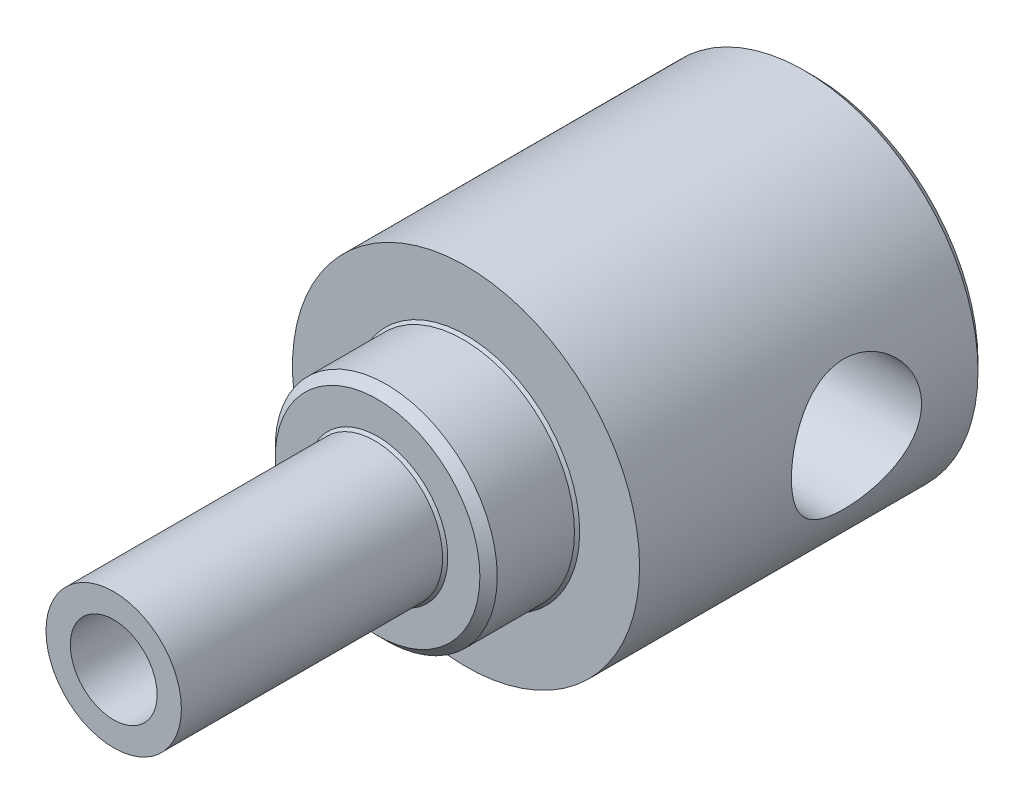
ISO-10303-21;
HEADER;
FILE_DESCRIPTION(('STEP AP214'),'2;1');
FILE_NAME('part.step','',(''),(''),'','','');
FILE_SCHEMA(('AUTOMOTIVE_DESIGN { 1 0 10303 214 1 1 1 1 }'));
ENDSEC;
DATA;
#1=APPLICATION_CONTEXT('core data for automotive mechanical design processes');
#2=APPLICATION_PROTOCOL_DEFINITION('international standard','automotive_design',2000,#1);
#3=PRODUCT_CONTEXT('',#1,'mechanical');
#4=PRODUCT('Part','Part','',(#3));
#5=PRODUCT_RELATED_PRODUCT_CATEGORY('part','',(#4));
#6=PRODUCT_DEFINITION_FORMATION('','',#4);
#7=PRODUCT_DEFINITION_CONTEXT('part definition',#1,'design');
#8=PRODUCT_DEFINITION('design','',#6,#7);
#9=PRODUCT_DEFINITION_SHAPE('','',#8);
#10=(LENGTH_UNIT() NAMED_UNIT(*) SI_UNIT(.MILLI.,.METRE.));
#11=(NAMED_UNIT(*) PLANE_ANGLE_UNIT() SI_UNIT($,.RADIAN.));
#12=(NAMED_UNIT(*) SI_UNIT($,.STERADIAN.) SOLID_ANGLE_UNIT());
#13=UNCERTAINTY_MEASURE_WITH_UNIT(LENGTH_MEASURE(1.E-05),#10,'distance_accuracy_value','');
#14=(GEOMETRIC_REPRESENTATION_CONTEXT(3) GLOBAL_UNCERTAINTY_ASSIGNED_CONTEXT((#13)) GLOBAL_UNIT_ASSIGNED_CONTEXT((#10,
#11,#12)) REPRESENTATION_CONTEXT('',''));
#15=CARTESIAN_POINT('',(0.,0.,0.));
#16=DIRECTION('',(0.,0.,1.));
#17=DIRECTION('',(1.,0.,0.));
#18=AXIS2_PLACEMENT_3D('',#15,#16,#17);
#19=CARTESIAN_POINT('',(0.,0.,2.03));
#20=DIRECTION('',(0.,0.,-1.));
#21=DIRECTION('',(-1.,0.,0.));
#22=AXIS2_PLACEMENT_3D('',#19,#20,#21);
#23=CYLINDRICAL_SURFACE('',#22,0.39);
#24=CARTESIAN_POINT('',(0.,0.,2.03));
#25=DIRECTION('',(0.,0.,1.));
#26=DIRECTION('',(1.,0.,0.));
#27=AXIS2_PLACEMENT_3D('',#24,#25,#26);
#28=CIRCLE('',#27,0.39);
#29=CARTESIAN_POINT('',(0.39,0.,2.03));
#30=VERTEX_POINT('',#29);
#31=EDGE_CURVE('E112',#30,#30,#28,.T.);
#32=ORIENTED_EDGE('',*,*,#31,.F.);
#33=EDGE_LOOP('',(#32));
#34=FACE_BOUND('',#33,.T.);
#35=CARTESIAN_POINT('',(-0.39,0.,0.51));
#36=CARTESIAN_POINT('',(-0.390003573981913,-0.00499348404305622,0.509995390479054));
#37=CARTESIAN_POINT('',(-0.389904208520105,-0.00998427020335295,0.510415272070743));
#38=CARTESIAN_POINT('',(-0.389526423050962,-0.0198132713252226,0.512068228847062));
#39=CARTESIAN_POINT('',(-0.389248333755489,-0.0246517508053416,0.51329980217857));
#40=CARTESIAN_POINT('',(-0.388539725112788,-0.0340486367913724,0.516540671192501));
#41=CARTESIAN_POINT('',(-0.388109198324649,-0.0386070296127043,0.518550004840077));
#42=CARTESIAN_POINT('',(-0.387143030348064,-0.0473230701978567,0.523285467073371));
#43=CARTESIAN_POINT('',(-0.386607367869382,-0.0514806365386137,0.52601174087931));
#44=CARTESIAN_POINT('',(-0.385478646054653,-0.059348926913769,0.532154503984005));
#45=CARTESIAN_POINT('',(-0.38488481559396,-0.0630515818181911,0.535581187919083));
#46=CARTESIAN_POINT('',(-0.383711975823547,-0.0698354839927525,0.543006177894276));
#47=CARTESIAN_POINT('',(-0.383132969678231,-0.0729165995386855,0.547004604798953));
#48=CARTESIAN_POINT('',(-0.382047536413422,-0.0784068787389949,0.555521249367071));
#49=CARTESIAN_POINT('',(-0.381542124453942,-0.0808070114923703,0.560045423555429));
#50=CARTESIAN_POINT('',(-0.380672777514302,-0.0848083376280224,0.569445313240605));
#51=CARTESIAN_POINT('',(-0.380308733819645,-0.0864101452051284,0.574320755172328));
#52=CARTESIAN_POINT('',(-0.379853043513059,-0.0883874908642381,0.582685744482339));
#53=CARTESIAN_POINT('',(-0.379711526167933,-0.0889913169642096,0.586120331988936));
#54=CARTESIAN_POINT('',(-0.379521283289299,-0.0897977830259027,0.593036019418668));
#55=CARTESIAN_POINT('',(-0.379472484818407,-0.0900007383379553,0.596517080610444));
#56=CARTESIAN_POINT('',(-0.379473319220205,-0.09,0.6));
#57=B_SPLINE_CURVE_WITH_KNOTS('',3,(#35,#36,#37,#38,#39,#40,#41,#42,#43,#44,#45,#46,#47,#48,#49,
#50,#51,#52,#53,#54,#55,#56),.UNSPECIFIED.,.F.,.F.,(4,2,2,2,2,2,2,2,2,2,4),(0.,
0.0149577270488295,0.0298878555921555,0.0448187130182498,0.0597525971052398,0.0749216905734965,
0.0900939954914772,0.105458991894533,0.120812148854305,0.131259378789806,0.141698386994673),.UNSPECIFIED.);
#58=CARTESIAN_POINT('',(-0.386813908746828,-0.0497493718553337,0.525));
#59=VERTEX_POINT('',#58);
#60=CARTESIAN_POINT('',(-0.379473319220206,-0.0899999999999998,0.6));
#61=VERTEX_POINT('',#60);
#62=EDGE_CURVE('E215',#59,#61,#57,.T.);
#63=ORIENTED_EDGE('',*,*,#62,.F.);
#64=CARTESIAN_POINT('',(0.,0.,0.525));
#65=DIRECTION('',(0.,0.,1.));
#66=DIRECTION('',(1.,0.,0.));
#67=AXIS2_PLACEMENT_3D('',#64,#65,#66);
#68=CIRCLE('',#67,0.39);
#69=CARTESIAN_POINT('',(-0.386813908746829,0.0497493718553304,0.525));
#70=VERTEX_POINT('',#69);
#71=EDGE_CURVE('E255',#59,#70,#68,.T.);
#72=ORIENTED_EDGE('',*,*,#71,.T.);
#73=CARTESIAN_POINT('',(-0.379473319220205,0.09,0.6));
#74=CARTESIAN_POINT('',(-0.379469419670721,0.0900046121325419,0.595008255870319));
#75=CARTESIAN_POINT('',(-0.379571713229179,0.0895850203535354,0.590019352257919));
#76=CARTESIAN_POINT('',(-0.379959200845348,0.0879333968278323,0.580194534874053));
#77=CARTESIAN_POINT('',(-0.380244046534698,0.0867029123997232,0.575358348074915));
#78=CARTESIAN_POINT('',(-0.380967362557247,0.0834652123050407,0.56596619423198));
#79=CARTESIAN_POINT('',(-0.381405834060902,0.081457990720594,0.561410229323468));
#80=CARTESIAN_POINT('',(-0.382385604440047,0.0767274668969404,0.552698205337723));
#81=CARTESIAN_POINT('',(-0.382926926903542,0.0740040003378031,0.548542238326701));
#82=CARTESIAN_POINT('',(-0.384062928906286,0.0678641163075334,0.540672182854271));
#83=CARTESIAN_POINT('',(-0.38465834942969,0.0644368709050795,0.536966647487533));
#84=CARTESIAN_POINT('',(-0.385829005049533,0.0570095642038938,0.530177176897509));
#85=CARTESIAN_POINT('',(-0.386404236313494,0.0530093948727697,0.527093359171956));
#86=CARTESIAN_POINT('',(-0.387477959506141,0.0444911134504308,0.521600148442213));
#87=CARTESIAN_POINT('',(-0.38797544475904,0.0399673482353219,0.519199317156233));
#88=CARTESIAN_POINT('',(-0.388828730787453,0.0305682671857995,0.515196555432417));
#89=CARTESIAN_POINT('',(-0.389184636801013,0.0256932156637482,0.513594031376055));
#90=CARTESIAN_POINT('',(-0.389629742942753,0.0173262734539094,0.51161475608173));
#91=CARTESIAN_POINT('',(-0.389767803380643,0.0138891785569138,0.511010065542118));
#92=CARTESIAN_POINT('',(-0.389953269308914,0.00696863982609787,0.510202486987269));
#93=CARTESIAN_POINT('',(-0.390000749822874,0.00348523675780692,0.509999266446182));
#94=CARTESIAN_POINT('',(-0.390000000000255,2.74694234790485E-13,0.509999999998896));
#95=B_SPLINE_CURVE_WITH_KNOTS('',3,(#73,#74,#75,#76,#77,#78,#79,#80,#81,#82,#83,#84,#85,#86,#87,
#88,#89,#90,#91,#92,#93,#94),.UNSPECIFIED.,.F.,.F.,(4,2,2,2,2,2,2,2,2,2,4),(0.,
0.0149522390434612,0.0298760290122494,0.0447999326859618,0.0597272631722878,0.0749042569988167,
0.0900841164254572,0.105446632059966,0.120797707064649,0.131252376016773,0.141698382036021),.UNSPECIFIED.);
#96=CARTESIAN_POINT('',(-0.379473319220205,0.09,0.6));
#97=VERTEX_POINT('',#96);
#98=EDGE_CURVE('E228',#97,#70,#95,.T.);
#99=ORIENTED_EDGE('',*,*,#98,.F.);
#100=DIRECTION('',(0.,0.,-1.));
#101=VECTOR('',#100,1.);
#102=CARTESIAN_POINT('',(-0.379473319220205,0.0900000000000001,2.03));
#103=LINE('',#102,#101);
#104=CARTESIAN_POINT('',(-0.379473319220205,0.09,1.41));
#105=VERTEX_POINT('',#104);
#106=EDGE_CURVE('E236',#105,#97,#103,.T.);
#107=ORIENTED_EDGE('',*,*,#106,.F.);
#108=CARTESIAN_POINT('',(-0.379473319220206,-0.0899999999999999,1.41));
#109=CARTESIAN_POINT('',(-0.379469419887523,-0.0900046113034587,1.41499158668145));
#110=CARTESIAN_POINT('',(-0.379571706902541,-0.0895850463478752,1.41998033387261));
#111=CARTESIAN_POINT('',(-0.379959182987832,-0.0879334745040998,1.42980516055504));
#112=CARTESIAN_POINT('',(-0.380244035159054,-0.0867029639871329,1.43464150407447));
#113=CARTESIAN_POINT('',(-0.3809673677522,-0.0834651883835822,1.44403387336327));
#114=CARTESIAN_POINT('',(-0.381405846719146,-0.0814579306534438,1.44858990178697));
#115=CARTESIAN_POINT('',(-0.382385619845448,-0.0767273912600067,1.45730191347996));
#116=CARTESIAN_POINT('',(-0.38292693465544,-0.0740039657395931,1.46145781614631));
#117=CARTESIAN_POINT('',(-0.384062938206583,-0.0678640586194219,1.46932788079495));
#118=CARTESIAN_POINT('',(-0.384658369291179,-0.0644367289589389,1.47303347428764));
#119=CARTESIAN_POINT('',(-0.385829022078421,-0.0570094720332387,1.47982291534215));
#120=CARTESIAN_POINT('',(-0.386404240585479,-0.0530094547294066,1.48290666495298));
#121=CARTESIAN_POINT('',(-0.387477810257076,-0.0444922026531543,1.48839908569764));
#122=CARTESIAN_POINT('',(-0.387975177799717,-0.0399694380783504,1.49079939051862));
#123=CARTESIAN_POINT('',(-0.388828510912156,-0.0305715374153859,1.49480245361251));
#124=CARTESIAN_POINT('',(-0.389184501449783,-0.0256964637265442,1.49640535272358));
#125=CARTESIAN_POINT('',(-0.389709733747058,-0.0158219440541628,1.49874095673185));
#126=CARTESIAN_POINT('',(-0.389882110486474,-0.0108261268874325,1.49948828656345));
#127=CARTESIAN_POINT('',(-0.390031579734262,-0.00077714029145394,1.50013733575168));
#128=CARTESIAN_POINT('',(-0.390008692589383,0.00427602310744478,1.50003914321283));
#129=CARTESIAN_POINT('',(-0.389772578294638,0.0141949778245059,1.49901065699915));
#130=CARTESIAN_POINT('',(-0.389562963537571,0.0190625052989266,1.49809615479739));
#131=CARTESIAN_POINT('',(-0.388981097795011,0.02857303361289,1.4954862620337));
#132=CARTESIAN_POINT('',(-0.388608840284936,0.0332160254366503,1.49379084014421));
#133=CARTESIAN_POINT('',(-0.387737805264789,0.0421887991068171,1.48965368879051));
#134=CARTESIAN_POINT('',(-0.387238039746749,0.0465157791746464,1.48720609932659));
#135=CARTESIAN_POINT('',(-0.386166594062722,0.0547031539270286,1.48163854311458));
#136=CARTESIAN_POINT('',(-0.385594905015786,0.0585634908759636,1.47851849329869));
#137=CARTESIAN_POINT('',(-0.384426716747437,0.0658017373213646,1.47160953181118));
#138=CARTESIAN_POINT('',(-0.38382994934358,0.0691664965039653,1.46780687698392));
#139=CARTESIAN_POINT('',(-0.382690934759353,0.0752140224511687,1.45968389352286));
#140=CARTESIAN_POINT('',(-0.382148702498639,0.0778966028913197,1.45536342393065));
#141=CARTESIAN_POINT('',(-0.381179237320822,0.0825105558434735,1.44630385213208));
#142=CARTESIAN_POINT('',(-0.380752490714059,0.0844387664252337,1.44156308789224));
#143=CARTESIAN_POINT('',(-0.380068955050082,0.0874644857453208,1.43181548560193));
#144=CARTESIAN_POINT('',(-0.379811912771557,0.0885632325064331,1.42680905607467));
#145=CARTESIAN_POINT('',(-0.379594795426623,0.0894865089074196,1.41980049131784));
#146=CARTESIAN_POINT('',(-0.379549303436279,0.0896791162454702,1.41784395867174));
#147=CARTESIAN_POINT('',(-0.379488583912478,0.089935709620331,1.41392525420415));
#148=CARTESIAN_POINT('',(-0.379473306521465,0.0899999075493937,1.41196309703207));
#149=CARTESIAN_POINT('',(-0.379473319220225,0.0900000000000015,1.41));
#150=B_SPLINE_CURVE_WITH_KNOTS('',3,(#108,#109,#110,#111,#112,#113,#114,#115,#116,#117,#118,
#119,#120,#121,#122,#123,#124,#125,#126,#127,#128,#129,#130,#131,#132,#133,#134,#135,#136,#137,
#138,#139,#140,#141,#142,#143,#144,#145,#146,#147,#148,#149),.UNSPECIFIED.,.F.,.F.,(4,2,2,2,2,2,
2,2,2,2,2,2,2,2,2,2,2,2,2,2,4),(0.,0.0149517706768174,0.0298760290377431,0.0448001460569251,
0.0597272631866968,0.0749044954110684,0.0900841164431795,0.105442268392468,0.120797706814097,
0.135886547906178,0.150973816740752,0.165775400329849,0.180577577754458,0.19549813238397,
0.210420531180046,0.225686424667633,0.240956483282895,0.256289877432888,0.271600340107902,
0.277496389182992,0.28338270095603),.UNSPECIFIED.);
#151=CARTESIAN_POINT('',(-0.379473319220206,-0.0899999999999999,1.41));
#152=VERTEX_POINT('',#151);
#153=EDGE_CURVE('E108',#152,#105,#150,.T.);
#154=ORIENTED_EDGE('',*,*,#153,.F.);
#155=DIRECTION('',(0.,0.,-1.));
#156=VECTOR('',#155,1.);
#157=CARTESIAN_POINT('',(-0.379473319220206,-0.0899999999999998,2.03));
#158=LINE('',#157,#156);
#159=EDGE_CURVE('E262',#61,#152,#158,.F.);
#160=ORIENTED_EDGE('',*,*,#159,.F.);
#161=EDGE_LOOP('',(#63,#72,#99,#107,#154,#160));
#162=FACE_BOUND('',#161,.T.);
#163=ADVANCED_FACE('F44',(#34,#162),#23,.T.);
#164=CARTESIAN_POINT('',(0.,0.,-2.));
#165=DIRECTION('',(0.,0.,1.));
#166=DIRECTION('',(1.,0.,0.));
#167=AXIS2_PLACEMENT_3D('',#164,#165,#166);
#168=CYLINDRICAL_SURFACE('',#167,1.);
#169=CARTESIAN_POINT('',(-1.,0.,-1.625));
#170=CARTESIAN_POINT('',(-1.00000054364038,-0.0203087647344633,-1.62500072557578));
#171=CARTESIAN_POINT('',(-0.999375948207983,-0.0406125604454483,-1.6233450599379));
#172=CARTESIAN_POINT('',(-0.996946740017296,-0.08061336308809,-1.61679295118252));
#173=CARTESIAN_POINT('',(-0.995142297234891,-0.100310456996903,-1.61189697488236));
#174=CARTESIAN_POINT('',(-0.990547080978953,-0.13851519624772,-1.59906174955706));
#175=CARTESIAN_POINT('',(-0.987758210873942,-0.157025056040572,-1.59112837079454));
#176=CARTESIAN_POINT('',(-0.981471919413041,-0.192449827540061,-1.57247339674606));
#177=CARTESIAN_POINT('',(-0.977974308067594,-0.20936430979446,-1.56175105361403));
#178=CARTESIAN_POINT('',(-0.970465617429366,-0.241836604261467,-1.53734686723221));
#179=CARTESIAN_POINT('',(-0.966440006463946,-0.257317682537838,-1.52356743443489));
#180=CARTESIAN_POINT('',(-0.958400552173284,-0.285811053685867,-1.49364739133555));
#181=CARTESIAN_POINT('',(-0.954386712818773,-0.298822590897855,-1.47750606097899));
#182=CARTESIAN_POINT('',(-0.946656176563854,-0.32249550554012,-1.4425706331182));
#183=CARTESIAN_POINT('',(-0.942956622126213,-0.333048482989996,-1.42369890835975));
#184=CARTESIAN_POINT('',(-0.936499650519446,-0.350796615834614,-1.38428791146166));
#185=CARTESIAN_POINT('',(-0.933741857162724,-0.357993112400869,-1.36374930922539));
#186=CARTESIAN_POINT('',(-0.929636032326957,-0.368521077543443,-1.32247081493193));
#187=CARTESIAN_POINT('',(-0.928234811850985,-0.371998983050756,-1.30177374036202));
#188=CARTESIAN_POINT('',(-0.926845154619263,-0.375448891333818,-1.26004596046715));
#189=CARTESIAN_POINT('',(-0.926856134400112,-0.375422342006888,-1.23901539651731));
#190=CARTESIAN_POINT('',(-0.928243778843706,-0.371976074023889,-1.19855761869985));
#191=CARTESIAN_POINT('',(-0.929538672114408,-0.368759521272199,-1.17910977348979));
#192=CARTESIAN_POINT('',(-0.933212345212229,-0.359360419671135,-1.14105321239784));
#193=CARTESIAN_POINT('',(-0.935591288264298,-0.35317742415823,-1.12244462334631));
#194=CARTESIAN_POINT('',(-0.941214255458168,-0.337909371429674,-1.08618073306817));
#195=CARTESIAN_POINT('',(-0.944473794965724,-0.328771621842729,-1.06855012846974));
#196=CARTESIAN_POINT('',(-0.95148552535299,-0.307890184406767,-1.0350135656022));
#197=CARTESIAN_POINT('',(-0.955237886144189,-0.296145596822248,-1.01910820562006));
#198=CARTESIAN_POINT('',(-0.9631200971464,-0.269454451916365,-0.988349084087298));
#199=CARTESIAN_POINT('',(-0.967258368638806,-0.254345746792387,-0.973637839812981));
#200=CARTESIAN_POINT('',(-0.975229320410584,-0.221828147704757,-0.946915508448546));
#201=CARTESIAN_POINT('',(-0.97906195366498,-0.204418900874342,-0.934904836348581));
#202=CARTESIAN_POINT('',(-0.986065987022598,-0.167430859248104,-0.913767400734371));
#203=CARTESIAN_POINT('',(-0.989226245649014,-0.14782267846118,-0.904688104694735));
#204=CARTESIAN_POINT('',(-0.994446795817431,-0.107209212631146,-0.890004348932489));
#205=CARTESIAN_POINT('',(-0.996507575853736,-0.086204552711442,-0.88439834585972));
#206=CARTESIAN_POINT('',(-0.99921110807016,-0.044593810787166,-0.877094303114516));
#207=CARTESIAN_POINT('',(-0.999923422564228,-0.0240259048905516,-0.875204348404374));
#208=CARTESIAN_POINT('',(-1.0000647342503,0.0171431188137555,-0.874827234025019));
#209=CARTESIAN_POINT('',(-0.999494015967107,0.0377442282458409,-0.876339319920801));
#210=CARTESIAN_POINT('',(-0.997179274431657,0.0775655121404672,-0.882577510577172));
#211=CARTESIAN_POINT('',(-0.995481177405943,0.0968083320018425,-0.887177885934289));
#212=CARTESIAN_POINT('',(-0.991128692729112,0.134235438739297,-0.899296518136812));
#213=CARTESIAN_POINT('',(-0.988474180704401,0.152419587586852,-0.906815154486943));
#214=CARTESIAN_POINT('',(-0.982374061019898,0.187811941277571,-0.924796603109936));
#215=CARTESIAN_POINT('',(-0.978907500525996,0.204975770889572,-0.935339432306102));
#216=CARTESIAN_POINT('',(-0.971566678909033,0.237348177931534,-0.958979525792633));
#217=CARTESIAN_POINT('',(-0.967692267513977,0.252556030067155,-0.972077733135332));
#218=CARTESIAN_POINT('',(-0.959683323737856,0.28150769968662,-1.00135103053208));
#219=CARTESIAN_POINT('',(-0.955546741299118,0.295115385310778,-1.01766054569705));
#220=CARTESIAN_POINT('',(-0.947697039327335,0.319427625077901,-1.05241284617304));
#221=CARTESIAN_POINT('',(-0.943983957837181,0.330131918529352,-1.07085582283263));
#222=CARTESIAN_POINT('',(-0.937417074706252,0.348344433802637,-1.10950399670375));
#223=CARTESIAN_POINT('',(-0.934566901381225,0.355839213640366,-1.12971618652393));
#224=CARTESIAN_POINT('',(-0.930135082687835,0.367269708690373,-1.17125244097115));
#225=CARTESIAN_POINT('',(-0.928552652595015,0.371207625769266,-1.19257580906596));
#226=CARTESIAN_POINT('',(-0.926939737027092,0.375215867739331,-1.23425403986796));
#227=CARTESIAN_POINT('',(-0.92681611188795,0.375518328740143,-1.25458315790885));
#228=CARTESIAN_POINT('',(-0.927896032504864,0.37284178910712,-1.2949863290572));
#229=CARTESIAN_POINT('',(-0.929099452417085,0.369863099625191,-1.31506040616764));
#230=CARTESIAN_POINT('',(-0.932620353799477,0.360889539074316,-1.35376180668543));
#231=CARTESIAN_POINT('',(-0.934902713397605,0.354989495790965,-1.37241458656303));
#232=CARTESIAN_POINT('',(-0.940303870788675,0.340424241950145,-1.40847637712191));
#233=CARTESIAN_POINT('',(-0.943422880000124,0.331758332362456,-1.42588507201707));
#234=CARTESIAN_POINT('',(-0.95034930974719,0.311380189845284,-1.4599566974249));
#235=CARTESIAN_POINT('',(-0.954184246098995,0.299532082007499,-1.47653269920011));
#236=CARTESIAN_POINT('',(-0.96201561689636,0.273336214324792,-1.50753539024267));
#237=CARTESIAN_POINT('',(-0.9660121023588,0.258987660032028,-1.52196139369665));
#238=CARTESIAN_POINT('',(-0.973976061523714,0.227270099196148,-1.5490504889555));
#239=CARTESIAN_POINT('',(-0.977930262251346,0.209779661053246,-1.56157593835868));
#240=CARTESIAN_POINT('',(-0.985136286142841,0.172803305800207,-1.58350566381913));
#241=CARTESIAN_POINT('',(-0.98838805462897,0.153317233522656,-1.59290969693409));
#242=CARTESIAN_POINT('',(-0.993935731516625,0.111999770500577,-1.60859420726208));
#243=CARTESIAN_POINT('',(-0.996184142895872,0.0901033555585518,-1.61472176615047));
#244=CARTESIAN_POINT('',(-0.999215605448985,0.0454689334015956,-1.62292323998017));
#245=CARTESIAN_POINT('',(-0.999999391509915,0.0227313540912148,-1.62499918787183));
#246=CARTESIAN_POINT('',(-1.,0.,-1.625));
#247=B_SPLINE_CURVE_WITH_KNOTS('',3,(#169,#170,#171,#172,#173,#174,#175,#176,#177,#178,#179,
#180,#181,#182,#183,#184,#185,#186,#187,#188,#189,#190,#191,#192,#193,#194,#195,#196,#197,#198,
#199,#200,#201,#202,#203,#204,#205,#206,#207,#208,#209,#210,#211,#212,#213,#214,#215,#216,#217,
#218,#219,#220,#221,#222,#223,#224,#225,#226,#227,#228,#229,#230,#231,#232,#233,#234,#235,#236,
#237,#238,#239,#240,#241,#242,#243,#244,#245,#246),.UNSPECIFIED.,.T.,.F.,(4,2,2,2,2,2,2,2,2,2,2,
2,2,2,2,2,2,2,2,2,2,2,2,2,2,2,2,2,2,2,2,2,2,2,2,2,2,2,4),(0.,0.0608424503901399,
0.121676137382615,0.182392842303393,0.243125844902372,0.306184046456788,0.369261512314054,
0.434741686254146,0.500195673380335,0.562964686010986,0.625707765135572,0.684695862736232,
0.743692845087777,0.80380602090385,0.863939976796951,0.928115383275836,0.992300644698969,
1.05747843815149,1.12262724918342,1.18431254902612,1.24598417091261,1.3052860947459,
1.36459573307244,1.4256480545853,1.48672294998597,1.55134129857545,1.61596544723666,
1.6808576667413,1.74570968729965,1.80639690858919,1.86707837539744,1.92590785593563,
1.98475221651056,2.04668117957997,2.10862985486195,2.17393082400439,2.23923687438205,
2.3073712874494,2.37547150435961),.UNSPECIFIED.);
#248=CARTESIAN_POINT('',(-1.,0.,-1.625));
#249=VERTEX_POINT('',#248);
#250=EDGE_CURVE('E181',#249,#249,#247,.T.);
#251=ORIENTED_EDGE('',*,*,#250,.F.);
#252=EDGE_LOOP('',(#251));
#253=FACE_BOUND('',#252,.T.);
#254=CARTESIAN_POINT('',(1.,0.,-1.625));
#255=CARTESIAN_POINT('',(1.00000054364038,0.0203087647344633,-1.62500072557578));
#256=CARTESIAN_POINT('',(0.999375948207983,0.0406125604454483,-1.6233450599379));
#257=CARTESIAN_POINT('',(0.996946740017296,0.08061336308809,-1.61679295118252));
#258=CARTESIAN_POINT('',(0.995142297234891,0.100310456996903,-1.61189697488236));
#259=CARTESIAN_POINT('',(0.990547080978953,0.13851519624772,-1.59906174955706));
#260=CARTESIAN_POINT('',(0.987758210873942,0.157025056040572,-1.59112837079454));
#261=CARTESIAN_POINT('',(0.981471919413041,0.192449827540061,-1.57247339674606));
#262=CARTESIAN_POINT('',(0.977974308067594,0.20936430979446,-1.56175105361403));
#263=CARTESIAN_POINT('',(0.970465617429366,0.241836604261467,-1.53734686723221));
#264=CARTESIAN_POINT('',(0.966440006463946,0.257317682537838,-1.52356743443489));
#265=CARTESIAN_POINT('',(0.958400552173284,0.285811053685867,-1.49364739133555));
#266=CARTESIAN_POINT('',(0.954386712818773,0.298822590897855,-1.47750606097899));
#267=CARTESIAN_POINT('',(0.946656176563854,0.32249550554012,-1.4425706331182));
#268=CARTESIAN_POINT('',(0.942956622126213,0.333048482989996,-1.42369890835975));
#269=CARTESIAN_POINT('',(0.936499650519446,0.350796615834614,-1.38428791146166));
#270=CARTESIAN_POINT('',(0.933741857162724,0.357993112400869,-1.36374930922539));
#271=CARTESIAN_POINT('',(0.929636032326957,0.368521077543443,-1.32247081493193));
#272=CARTESIAN_POINT('',(0.928234811850985,0.371998983050756,-1.30177374036202));
#273=CARTESIAN_POINT('',(0.926845154619263,0.375448891333818,-1.26004596046715));
#274=CARTESIAN_POINT('',(0.926856134400112,0.375422342006888,-1.23901539651731));
#275=CARTESIAN_POINT('',(0.928243778843706,0.371976074023889,-1.19855761869985));
#276=CARTESIAN_POINT('',(0.929538672114408,0.368759521272199,-1.17910977348979));
#277=CARTESIAN_POINT('',(0.933212345212229,0.359360419671135,-1.14105321239784));
#278=CARTESIAN_POINT('',(0.935591288264298,0.35317742415823,-1.12244462334631));
#279=CARTESIAN_POINT('',(0.941214255458168,0.337909371429674,-1.08618073306817));
#280=CARTESIAN_POINT('',(0.944473794965724,0.328771621842729,-1.06855012846974));
#281=CARTESIAN_POINT('',(0.95148552535299,0.307890184406767,-1.0350135656022));
#282=CARTESIAN_POINT('',(0.955237886144189,0.296145596822248,-1.01910820562006));
#283=CARTESIAN_POINT('',(0.9631200971464,0.269454451916365,-0.988349084087298));
#284=CARTESIAN_POINT('',(0.967258368638806,0.254345746792387,-0.973637839812981));
#285=CARTESIAN_POINT('',(0.975229320410584,0.221828147704757,-0.946915508448546));
#286=CARTESIAN_POINT('',(0.97906195366498,0.204418900874342,-0.934904836348581));
#287=CARTESIAN_POINT('',(0.986065987022598,0.167430859248104,-0.913767400734371));
#288=CARTESIAN_POINT('',(0.989226245649014,0.14782267846118,-0.904688104694735));
#289=CARTESIAN_POINT('',(0.994446795817431,0.107209212631146,-0.890004348932489));
#290=CARTESIAN_POINT('',(0.996507575853736,0.086204552711442,-0.88439834585972));
#291=CARTESIAN_POINT('',(0.99921110807016,0.044593810787166,-0.877094303114516));
#292=CARTESIAN_POINT('',(0.999923422564228,0.0240259048905516,-0.875204348404374));
#293=CARTESIAN_POINT('',(1.0000647342503,-0.0171431188137555,-0.874827234025019));
#294=CARTESIAN_POINT('',(0.999494015967107,-0.0377442282458409,-0.876339319920801));
#295=CARTESIAN_POINT('',(0.997179274431657,-0.0775655121404672,-0.882577510577172));
#296=CARTESIAN_POINT('',(0.995481177405943,-0.0968083320018425,-0.887177885934289));
#297=CARTESIAN_POINT('',(0.991128692729112,-0.134235438739297,-0.899296518136812));
#298=CARTESIAN_POINT('',(0.988474180704401,-0.152419587586852,-0.906815154486943));
#299=CARTESIAN_POINT('',(0.982374061019898,-0.187811941277571,-0.924796603109936));
#300=CARTESIAN_POINT('',(0.978907500525996,-0.204975770889572,-0.935339432306102));
#301=CARTESIAN_POINT('',(0.971566678909033,-0.237348177931534,-0.958979525792633));
#302=CARTESIAN_POINT('',(0.967692267513977,-0.252556030067155,-0.972077733135332));
#303=CARTESIAN_POINT('',(0.959683323737856,-0.28150769968662,-1.00135103053208));
#304=CARTESIAN_POINT('',(0.955546741299118,-0.295115385310778,-1.01766054569705));
#305=CARTESIAN_POINT('',(0.947697039327335,-0.319427625077901,-1.05241284617304));
#306=CARTESIAN_POINT('',(0.943983957837181,-0.330131918529352,-1.07085582283263));
#307=CARTESIAN_POINT('',(0.937417074706252,-0.348344433802637,-1.10950399670375));
#308=CARTESIAN_POINT('',(0.934566901381225,-0.355839213640366,-1.12971618652393));
#309=CARTESIAN_POINT('',(0.930135082687835,-0.367269708690373,-1.17125244097115));
#310=CARTESIAN_POINT('',(0.928552652595015,-0.371207625769266,-1.19257580906596));
#311=CARTESIAN_POINT('',(0.926939737027092,-0.375215867739331,-1.23425403986796));
#312=CARTESIAN_POINT('',(0.92681611188795,-0.375518328740143,-1.25458315790885));
#313=CARTESIAN_POINT('',(0.927896032504864,-0.37284178910712,-1.2949863290572));
#314=CARTESIAN_POINT('',(0.929099452417085,-0.369863099625191,-1.31506040616764));
#315=CARTESIAN_POINT('',(0.932620353799477,-0.360889539074316,-1.35376180668543));
#316=CARTESIAN_POINT('',(0.934902713397605,-0.354989495790965,-1.37241458656303));
#317=CARTESIAN_POINT('',(0.940303870788675,-0.340424241950145,-1.40847637712191));
#318=CARTESIAN_POINT('',(0.943422880000124,-0.331758332362456,-1.42588507201707));
#319=CARTESIAN_POINT('',(0.95034930974719,-0.311380189845284,-1.4599566974249));
#320=CARTESIAN_POINT('',(0.954184246098995,-0.299532082007499,-1.47653269920011));
#321=CARTESIAN_POINT('',(0.96201561689636,-0.273336214324792,-1.50753539024267));
#322=CARTESIAN_POINT('',(0.9660121023588,-0.258987660032028,-1.52196139369665));
#323=CARTESIAN_POINT('',(0.973976061523714,-0.227270099196148,-1.5490504889555));
#324=CARTESIAN_POINT('',(0.977930262251346,-0.209779661053246,-1.56157593835868));
#325=CARTESIAN_POINT('',(0.985136286142841,-0.172803305800207,-1.58350566381913));
#326=CARTESIAN_POINT('',(0.98838805462897,-0.153317233522656,-1.59290969693409));
#327=CARTESIAN_POINT('',(0.993935731516625,-0.111999770500577,-1.60859420726208));
#328=CARTESIAN_POINT('',(0.996184142895872,-0.0901033555585518,-1.61472176615047));
#329=CARTESIAN_POINT('',(0.999215605448985,-0.0454689334015956,-1.62292323998017));
#330=CARTESIAN_POINT('',(0.999999391509915,-0.0227313540912148,-1.62499918787183));
#331=CARTESIAN_POINT('',(1.,0.,-1.625));
#332=B_SPLINE_CURVE_WITH_KNOTS('',3,(#254,#255,#256,#257,#258,#259,#260,#261,#262,#263,#264,
#265,#266,#267,#268,#269,#270,#271,#272,#273,#274,#275,#276,#277,#278,#279,#280,#281,#282,#283,
#284,#285,#286,#287,#288,#289,#290,#291,#292,#293,#294,#295,#296,#297,#298,#299,#300,#301,#302,
#303,#304,#305,#306,#307,#308,#309,#310,#311,#312,#313,#314,#315,#316,#317,#318,#319,#320,#321,
#322,#323,#324,#325,#326,#327,#328,#329,#330,#331),.UNSPECIFIED.,.T.,.F.,(4,2,2,2,2,2,2,2,2,2,2,
2,2,2,2,2,2,2,2,2,2,2,2,2,2,2,2,2,2,2,2,2,2,2,2,2,2,2,4),(0.,0.0608424503901399,
0.121676137382615,0.182392842303393,0.243125844902372,0.306184046456788,0.369261512314054,
0.434741686254146,0.500195673380335,0.562964686010986,0.625707765135572,0.684695862736232,
0.743692845087777,0.80380602090385,0.863939976796951,0.928115383275836,0.992300644698969,
1.05747843815149,1.12262724918342,1.18431254902612,1.24598417091261,1.3052860947459,
1.36459573307244,1.4256480545853,1.48672294998597,1.55134129857545,1.61596544723666,
1.6808576667413,1.74570968729965,1.80639690858919,1.86707837539744,1.92590785593563,
1.98475221651056,2.04668117957997,2.10862985486195,2.17393082400439,2.23923687438205,
2.3073712874494,2.37547150435961),.UNSPECIFIED.);
#333=CARTESIAN_POINT('',(1.,0.,-1.625));
#334=VERTEX_POINT('',#333);
#335=EDGE_CURVE('E172',#334,#334,#332,.T.);
#336=ORIENTED_EDGE('',*,*,#335,.F.);
#337=EDGE_LOOP('',(#336));
#338=FACE_BOUND('',#337,.T.);
#339=CARTESIAN_POINT('',(0.,0.,-1.95));
#340=DIRECTION('',(0.,0.,1.));
#341=DIRECTION('',(1.,0.,0.));
#342=AXIS2_PLACEMENT_3D('',#339,#340,#341);
#343=CIRCLE('',#342,1.);
#344=CARTESIAN_POINT('',(1.,0.,-1.95));
#345=VERTEX_POINT('',#344);
#346=EDGE_CURVE('E164',#345,#345,#343,.T.);
#347=ORIENTED_EDGE('',*,*,#346,.T.);
#348=EDGE_LOOP('',(#347));
#349=FACE_BOUND('',#348,.T.);
#350=CARTESIAN_POINT('',(0.,0.,0.));
#351=DIRECTION('',(0.,0.,1.));
#352=DIRECTION('',(1.,0.,0.));
#353=AXIS2_PLACEMENT_3D('',#350,#351,#352);
#354=CIRCLE('',#353,1.);
#355=CARTESIAN_POINT('',(1.,0.,0.));
#356=VERTEX_POINT('',#355);
#357=EDGE_CURVE('E152',#356,#356,#354,.T.);
#358=ORIENTED_EDGE('',*,*,#357,.F.);
#359=EDGE_LOOP('',(#358));
#360=FACE_BOUND('',#359,.T.);
#361=ADVANCED_FACE('F186',(#253,#338,#349,#360),#168,.T.);
#362=CARTESIAN_POINT('',(0.,0.,-2.));
#363=DIRECTION('',(0.,0.,1.));
#364=DIRECTION('',(1.,0.,0.));
#365=AXIS2_PLACEMENT_3D('',#362,#363,#364);
#366=PLANE('',#365);
#367=CARTESIAN_POINT('',(0.,0.,-2.));
#368=DIRECTION('',(0.,0.,1.));
#369=DIRECTION('',(1.,0.,0.));
#370=AXIS2_PLACEMENT_3D('',#367,#368,#369);
#371=CIRCLE('',#370,0.95);
#372=CARTESIAN_POINT('',(0.95,0.,-2.));
#373=VERTEX_POINT('',#372);
#374=EDGE_CURVE('E168',#373,#373,#371,.F.);
#375=ORIENTED_EDGE('',*,*,#374,.T.);
#376=EDGE_LOOP('',(#375));
#377=FACE_BOUND('',#376,.T.);
#378=ADVANCED_FACE('F372',(#377),#366,.F.);
#379=CARTESIAN_POINT('',(0.,0.,0.));
#380=DIRECTION('',(0.,0.,1.));
#381=DIRECTION('',(1.,0.,0.));
#382=AXIS2_PLACEMENT_3D('',#379,#380,#381);
#383=PLANE('',#382);
#384=CARTESIAN_POINT('',(0.,0.,0.));
#385=DIRECTION('',(0.,0.,1.));
#386=DIRECTION('',(1.,0.,0.));
#387=AXIS2_PLACEMENT_3D('',#384,#385,#386);
#388=CIRCLE('',#387,0.655);
#389=CARTESIAN_POINT('',(0.655,0.,0.));
#390=VERTEX_POINT('',#389);
#391=EDGE_CURVE('E296',#390,#390,#388,.F.);
#392=ORIENTED_EDGE('',*,*,#391,.T.);
#393=EDGE_LOOP('',(#392));
#394=FACE_BOUND('',#393,.T.);
#395=ORIENTED_EDGE('',*,*,#357,.T.);
#396=EDGE_LOOP('',(#395));
#397=FACE_BOUND('',#396,.T.);
#398=ADVANCED_FACE('F366',(#394,#397),#383,.T.);
#399=CARTESIAN_POINT('',(0.,0.,0.51));
#400=DIRECTION('',(0.,0.,-1.));
#401=DIRECTION('',(-1.,0.,0.));
#402=AXIS2_PLACEMENT_3D('',#399,#400,#401);
#403=CYLINDRICAL_SURFACE('',#402,0.64);
#404=CARTESIAN_POINT('',(0.,0.,0.0149999999999993));
#405=DIRECTION('',(0.,0.,1.));
#406=DIRECTION('',(1.,0.,0.));
#407=AXIS2_PLACEMENT_3D('',#404,#405,#406);
#408=CIRCLE('',#407,0.64);
#409=CARTESIAN_POINT('',(0.64,0.,0.0149999999999993));
#410=VERTEX_POINT('',#409);
#411=EDGE_CURVE('E299',#410,#410,#408,.T.);
#412=ORIENTED_EDGE('',*,*,#411,.T.);
#413=EDGE_LOOP('',(#412));
#414=FACE_BOUND('',#413,.T.);
#415=CARTESIAN_POINT('',(0.,0.,0.459999999999999));
#416=DIRECTION('',(0.,0.,1.));
#417=DIRECTION('',(1.,0.,0.));
#418=AXIS2_PLACEMENT_3D('',#415,#416,#417);
#419=CIRCLE('',#418,0.64);
#420=CARTESIAN_POINT('',(0.64,0.,0.459999999999999));
#421=VERTEX_POINT('',#420);
#422=EDGE_CURVE('E160',#421,#421,#419,.F.);
#423=ORIENTED_EDGE('',*,*,#422,.T.);
#424=EDGE_LOOP('',(#423));
#425=FACE_BOUND('',#424,.T.);
#426=ADVANCED_FACE('F268',(#414,#425),#403,.T.);
#427=CARTESIAN_POINT('',(0.,0.,0.51));
#428=DIRECTION('',(0.,0.,1.));
#429=DIRECTION('',(1.,0.,0.));
#430=AXIS2_PLACEMENT_3D('',#427,#428,#429);
#431=PLANE('',#430);
#432=CARTESIAN_POINT('',(0.,0.,0.51));
#433=DIRECTION('',(0.,0.,1.));
#434=DIRECTION('',(1.,0.,0.));
#435=AXIS2_PLACEMENT_3D('',#432,#433,#434);
#436=CIRCLE('',#435,0.405);
#437=CARTESIAN_POINT('',(-0.405,0.,0.51));
#438=VERTEX_POINT('',#437);
#439=EDGE_CURVE('E67',#438,#438,#436,.F.);
#440=ORIENTED_EDGE('',*,*,#439,.T.);
#441=EDGE_LOOP('',(#440));
#442=FACE_BOUND('',#441,.T.);
#443=CARTESIAN_POINT('',(0.,0.,0.51));
#444=DIRECTION('',(0.,0.,1.));
#445=DIRECTION('',(1.,0.,0.));
#446=AXIS2_PLACEMENT_3D('',#443,#444,#445);
#447=CIRCLE('',#446,0.589999999999999);
#448=CARTESIAN_POINT('',(0.589999999999999,0.,0.51));
#449=VERTEX_POINT('',#448);
#450=EDGE_CURVE('E156',#449,#449,#447,.T.);
#451=ORIENTED_EDGE('',*,*,#450,.T.);
#452=EDGE_LOOP('',(#451));
#453=FACE_BOUND('',#452,.T.);
#454=ADVANCED_FACE('F205',(#442,#453),#431,.T.);
#455=CARTESIAN_POINT('',(0.,0.,2.03));
#456=DIRECTION('',(0.,0.,1.));
#457=DIRECTION('',(1.,0.,0.));
#458=AXIS2_PLACEMENT_3D('',#455,#456,#457);
#459=PLANE('',#458);
#460=CARTESIAN_POINT('',(0.,0.,2.03));
#461=DIRECTION('',(0.,0.,1.));
#462=DIRECTION('',(1.,0.,0.));
#463=AXIS2_PLACEMENT_3D('',#460,#461,#462);
#464=CIRCLE('',#463,0.25);
#465=CARTESIAN_POINT('',(0.25,0.,2.03));
#466=VERTEX_POINT('',#465);
#467=EDGE_CURVE('E133',#466,#466,#464,.T.);
#468=ORIENTED_EDGE('',*,*,#467,.F.);
#469=EDGE_LOOP('',(#468));
#470=FACE_BOUND('',#469,.T.);
#471=ORIENTED_EDGE('',*,*,#31,.T.);
#472=EDGE_LOOP('',(#471));
#473=FACE_BOUND('',#472,.T.);
#474=ADVANCED_FACE('F200',(#470,#473),#459,.T.);
#475=CARTESIAN_POINT('',(0.,0.,0.51));
#476=DIRECTION('',(0.,0.,-1.));
#477=DIRECTION('',(-1.,0.,0.));
#478=AXIS2_PLACEMENT_3D('',#475,#476,#477);
#479=CONICAL_SURFACE('',#478,0.589999999999999,0.785398163397444);
#480=ORIENTED_EDGE('',*,*,#422,.F.);
#481=EDGE_LOOP('',(#480));
#482=FACE_BOUND('',#481,.T.);
#483=ORIENTED_EDGE('',*,*,#450,.F.);
#484=EDGE_LOOP('',(#483));
#485=FACE_BOUND('',#484,.T.);
#486=ADVANCED_FACE('F204',(#482,#485),#479,.T.);
#487=CARTESIAN_POINT('',(0.,0.,-1.95));
#488=DIRECTION('',(0.,0.,1.));
#489=DIRECTION('',(1.,0.,0.));
#490=AXIS2_PLACEMENT_3D('',#487,#488,#489);
#491=CONICAL_SURFACE('',#490,1.,0.785398163397444);
#492=ORIENTED_EDGE('',*,*,#374,.F.);
#493=EDGE_LOOP('',(#492));
#494=FACE_BOUND('',#493,.T.);
#495=ORIENTED_EDGE('',*,*,#346,.F.);
#496=EDGE_LOOP('',(#495));
#497=FACE_BOUND('',#496,.T.);
#498=ADVANCED_FACE('F196',(#494,#497),#491,.T.);
#499=CARTESIAN_POINT('',(-1.,0.,-1.25));
#500=DIRECTION('',(1.,0.,0.));
#501=DIRECTION('',(0.,0.,-1.));
#502=AXIS2_PLACEMENT_3D('',#499,#500,#501);
#503=CYLINDRICAL_SURFACE('',#502,0.375);
#504=ORIENTED_EDGE('',*,*,#250,.T.);
#505=EDGE_LOOP('',(#504));
#506=FACE_BOUND('',#505,.T.);
#507=ORIENTED_EDGE('',*,*,#335,.T.);
#508=EDGE_LOOP('',(#507));
#509=FACE_BOUND('',#508,.T.);
#510=ADVANCED_FACE('F190',(#506,#509),#503,.F.);
#511=CARTESIAN_POINT('',(0.,0.,0.0149999999999993));
#512=DIRECTION('',(0.,0.,-1.));
#513=DIRECTION('',(-1.,0.,0.));
#514=AXIS2_PLACEMENT_3D('',#511,#512,#513);
#515=CONICAL_SURFACE('',#514,0.64,0.785398163397463);
#516=ORIENTED_EDGE('',*,*,#391,.F.);
#517=EDGE_LOOP('',(#516));
#518=FACE_BOUND('',#517,.T.);
#519=ORIENTED_EDGE('',*,*,#411,.F.);
#520=EDGE_LOOP('',(#519));
#521=FACE_BOUND('',#520,.T.);
#522=ADVANCED_FACE('F195',(#518,#521),#515,.T.);
#523=CARTESIAN_POINT('',(-0.48375,0.,1.41));
#524=DIRECTION('',(1.,0.,0.));
#525=DIRECTION('',(0.,0.,-1.));
#526=AXIS2_PLACEMENT_3D('',#523,#524,#525);
#527=CYLINDRICAL_SURFACE('',#526,0.09);
#528=ORIENTED_EDGE('',*,*,#153,.T.);
#529=DIRECTION('',(1.,0.,0.));
#530=VECTOR('',#529,1.);
#531=CARTESIAN_POINT('',(-0.48375,0.09,1.41));
#532=LINE('',#531,#530);
#533=CARTESIAN_POINT('',(-0.29625,0.09,1.41));
#534=VERTEX_POINT('',#533);
#535=EDGE_CURVE('E100',#105,#534,#532,.T.);
#536=ORIENTED_EDGE('',*,*,#535,.T.);
#537=CARTESIAN_POINT('',(-0.29625,0.,1.41));
#538=DIRECTION('',(-1.,0.,0.));
#539=DIRECTION('',(0.,0.,1.));
#540=AXIS2_PLACEMENT_3D('',#537,#538,#539);
#541=CIRCLE('',#540,0.09);
#542=CARTESIAN_POINT('',(-0.29625,-0.0899999999999999,1.41));
#543=VERTEX_POINT('',#542);
#544=EDGE_CURVE('E105',#543,#534,#541,.T.);
#545=ORIENTED_EDGE('',*,*,#544,.F.);
#546=DIRECTION('',(1.,0.,0.));
#547=VECTOR('',#546,1.);
#548=CARTESIAN_POINT('',(-0.48375,-0.0899999999999999,1.41));
#549=LINE('',#548,#547);
#550=EDGE_CURVE('E141',#152,#543,#549,.T.);
#551=ORIENTED_EDGE('',*,*,#550,.F.);
#552=EDGE_LOOP('',(#528,#536,#545,#551));
#553=FACE_BOUND('',#552,.T.);
#554=ADVANCED_FACE('F102',(#553),#527,.F.);
#555=CARTESIAN_POINT('',(-0.48375,0.09,1.41));
#556=DIRECTION('',(0.,-1.,0.));
#557=DIRECTION('',(0.,0.,-1.));
#558=AXIS2_PLACEMENT_3D('',#555,#556,#557);
#559=PLANE('',#558);
#560=ORIENTED_EDGE('',*,*,#106,.T.);
#561=DIRECTION('',(1.,0.,0.));
#562=VECTOR('',#561,1.);
#563=CARTESIAN_POINT('',(-0.48375,0.09,0.6));
#564=LINE('',#563,#562);
#565=CARTESIAN_POINT('',(-0.29625,0.09,0.6));
#566=VERTEX_POINT('',#565);
#567=EDGE_CURVE('E113',#97,#566,#564,.T.);
#568=ORIENTED_EDGE('',*,*,#567,.T.);
#569=DIRECTION('',(0.,0.,-1.));
#570=VECTOR('',#569,1.);
#571=CARTESIAN_POINT('',(-0.29625,0.09,1.41));
#572=LINE('',#571,#570);
#573=EDGE_CURVE('E116',#534,#566,#572,.T.);
#574=ORIENTED_EDGE('',*,*,#573,.F.);
#575=ORIENTED_EDGE('',*,*,#535,.F.);
#576=EDGE_LOOP('',(#560,#568,#574,#575));
#577=FACE_BOUND('',#576,.T.);
#578=ADVANCED_FACE('F117',(#577),#559,.T.);
#579=CARTESIAN_POINT('',(-0.48375,0.,0.6));
#580=DIRECTION('',(1.,0.,0.));
#581=DIRECTION('',(0.,0.,-1.));
#582=AXIS2_PLACEMENT_3D('',#579,#580,#581);
#583=CYLINDRICAL_SURFACE('',#582,0.09);
#584=CARTESIAN_POINT('',(-0.386813908746829,0.0497493718553304,0.525));
#585=CARTESIAN_POINT('',(-0.389087355602815,0.0468988257416449,0.523108724165372));
#586=CARTESIAN_POINT('',(-0.39123882309934,0.0438565511674568,0.521325526624573));
#587=CARTESIAN_POINT('',(-0.395214761140745,0.0373596592710359,0.518038457090733));
#588=CARTESIAN_POINT('',(-0.397034219776118,0.0338998550792799,0.516538855590156));
#589=CARTESIAN_POINT('',(-0.400206039873981,0.0265897031561127,0.513929395298238));
#590=CARTESIAN_POINT('',(-0.401554405163358,0.0227363563298225,0.512822869612976));
#591=CARTESIAN_POINT('',(-0.403619427943871,0.0147783251444872,0.511129830699861));
#592=CARTESIAN_POINT('',(-0.404341037575276,0.0106758902916055,0.510539240725785));
#593=CARTESIAN_POINT('',(-0.404806598765428,0.00544620165711567,0.510158250250353));
#594=CARTESIAN_POINT('',(-0.404878974251227,0.00435999155527473,0.510099026314379));
#595=CARTESIAN_POINT('',(-0.404975649783011,0.00218271148474172,0.510019921274089));
#596=CARTESIAN_POINT('',(-0.404999892700416,0.00109163727966602,0.51000008692129));
#597=CARTESIAN_POINT('',(-0.405,0.,0.51));
#598=B_SPLINE_CURVE_WITH_KNOTS('',3,(#584,#585,#586,#587,#588,#589,#590,#591,#592,#593,#594,
#595,#596,#597),.UNSPECIFIED.,.F.,.F.,(4,2,2,2,2,2,4),(0.,0.0123392335037157,0.0248516070143874,
0.0374676803443157,0.0499831399218338,0.0532526071977926,0.0565259526924887),.UNSPECIFIED.);
#599=EDGE_CURVE('E60',#70,#438,#598,.T.);
#600=ORIENTED_EDGE('',*,*,#599,.T.);
#601=CARTESIAN_POINT('',(-0.405,0.,0.51));
#602=CARTESIAN_POINT('',(-0.405009918742853,-0.0039491951840707,0.509992218658439));
#603=CARTESIAN_POINT('',(-0.404682970157166,-0.00788218374934837,0.510259372542945));
#604=CARTESIAN_POINT('',(-0.403446417121441,-0.0155456693893914,0.511271730468647));
#605=CARTESIAN_POINT('',(-0.402543791218049,-0.0192780189120482,0.512011208994902));
#606=CARTESIAN_POINT('',(-0.400248597466165,-0.0264529844552509,0.513894924951241));
#607=CARTESIAN_POINT('',(-0.398858362297224,-0.029896884889876,0.515037235408136));
#608=CARTESIAN_POINT('',(-0.395689994571097,-0.0364764387757802,0.517646949322465));
#609=CARTESIAN_POINT('',(-0.393910684847217,-0.0396111139500542,0.519115339566749));
#610=CARTESIAN_POINT('',(-0.390356693450592,-0.0450886091263425,0.522056974981817));
#611=CARTESIAN_POINT('',(-0.388624613872152,-0.0474786653695415,0.523493708873374));
#612=CARTESIAN_POINT('',(-0.386813908746853,-0.0497493718553583,0.524999999999984));
#613=B_SPLINE_CURVE_WITH_KNOTS('',3,(#601,#602,#603,#604,#605,#606,#607,#608,#609,#610,#611,
#612),.UNSPECIFIED.,.F.,.F.,(4,2,2,2,2,4),(0.,0.0117994182938558,0.0234584506351879,
0.0350624513028073,0.0467020586502471,0.0565254054900029),.UNSPECIFIED.);
#614=EDGE_CURVE('E11',#438,#59,#613,.T.);
#615=ORIENTED_EDGE('',*,*,#614,.T.);
#616=ORIENTED_EDGE('',*,*,#62,.T.);
#617=DIRECTION('',(1.,0.,0.));
#618=VECTOR('',#617,1.);
#619=CARTESIAN_POINT('',(-0.48375,-0.09,0.6));
#620=LINE('',#619,#618);
#621=CARTESIAN_POINT('',(-0.29625,-0.09,0.6));
#622=VERTEX_POINT('',#621);
#623=EDGE_CURVE('E144',#61,#622,#620,.T.);
#624=ORIENTED_EDGE('',*,*,#623,.T.);
#625=CARTESIAN_POINT('',(-0.29625,0.,0.6));
#626=DIRECTION('',(-1.,0.,0.));
#627=DIRECTION('',(0.,0.,1.));
#628=AXIS2_PLACEMENT_3D('',#625,#626,#627);
#629=CIRCLE('',#628,0.09);
#630=EDGE_CURVE('E123',#566,#622,#629,.T.);
#631=ORIENTED_EDGE('',*,*,#630,.F.);
#632=ORIENTED_EDGE('',*,*,#567,.F.);
#633=ORIENTED_EDGE('',*,*,#98,.T.);
#634=EDGE_LOOP('',(#600,#615,#616,#624,#631,#632,#633));
#635=FACE_BOUND('',#634,.T.);
#636=ADVANCED_FACE('F238',(#635),#583,.F.);
#637=CARTESIAN_POINT('',(-0.48375,-0.0899999999999999,1.41));
#638=DIRECTION('',(0.,1.,0.));
#639=DIRECTION('',(0.,0.,1.));
#640=AXIS2_PLACEMENT_3D('',#637,#638,#639);
#641=PLANE('',#640);
#642=ORIENTED_EDGE('',*,*,#159,.T.);
#643=ORIENTED_EDGE('',*,*,#550,.T.);
#644=DIRECTION('',(0.,0.,1.));
#645=VECTOR('',#644,1.);
#646=CARTESIAN_POINT('',(-0.29625,-0.0899999999999999,1.41));
#647=LINE('',#646,#645);
#648=EDGE_CURVE('E127',#622,#543,#647,.T.);
#649=ORIENTED_EDGE('',*,*,#648,.F.);
#650=ORIENTED_EDGE('',*,*,#623,.F.);
#651=EDGE_LOOP('',(#642,#643,#649,#650));
#652=FACE_BOUND('',#651,.T.);
#653=ADVANCED_FACE('F242',(#652),#641,.T.);
#654=CARTESIAN_POINT('',(-0.29625,0.,1.41));
#655=DIRECTION('',(-1.,0.,0.));
#656=DIRECTION('',(0.,0.,1.));
#657=AXIS2_PLACEMENT_3D('',#654,#655,#656);
#658=PLANE('',#657);
#659=ORIENTED_EDGE('',*,*,#544,.T.);
#660=ORIENTED_EDGE('',*,*,#573,.T.);
#661=ORIENTED_EDGE('',*,*,#630,.T.);
#662=ORIENTED_EDGE('',*,*,#648,.T.);
#663=EDGE_LOOP('',(#659,#660,#661,#662));
#664=FACE_BOUND('',#663,.T.);
#665=ADVANCED_FACE('F125',(#664),#658,.T.);
#666=CARTESIAN_POINT('',(0.,0.,0.525));
#667=DIRECTION('',(0.,0.,-1.));
#668=DIRECTION('',(-1.,0.,0.));
#669=AXIS2_PLACEMENT_3D('',#666,#667,#668);
#670=CONICAL_SURFACE('',#669,0.39,0.785398163397463);
#671=ORIENTED_EDGE('',*,*,#614,.F.);
#672=ORIENTED_EDGE('',*,*,#439,.F.);
#673=ORIENTED_EDGE('',*,*,#599,.F.);
#674=ORIENTED_EDGE('',*,*,#71,.F.);
#675=EDGE_LOOP('',(#671,#672,#673,#674));
#676=FACE_BOUND('',#675,.T.);
#677=ADVANCED_FACE('F47',(#676),#670,.T.);
#678=CARTESIAN_POINT('',(0.,0.,1.28));
#679=DIRECTION('',(0.,0.,1.));
#680=DIRECTION('',(1.,0.,0.));
#681=AXIS2_PLACEMENT_3D('',#678,#679,#680);
#682=CYLINDRICAL_SURFACE('',#681,0.25);
#683=CARTESIAN_POINT('',(0.,0.,1.28));
#684=DIRECTION('',(0.,0.,1.));
#685=DIRECTION('',(1.,0.,0.));
#686=AXIS2_PLACEMENT_3D('',#683,#684,#685);
#687=CIRCLE('',#686,0.25);
#688=CARTESIAN_POINT('',(0.25,0.,1.28));
#689=VERTEX_POINT('',#688);
#690=EDGE_CURVE('E129',#689,#689,#687,.T.);
#691=ORIENTED_EDGE('',*,*,#690,.F.);
#692=EDGE_LOOP('',(#691));
#693=FACE_BOUND('',#692,.T.);
#694=ORIENTED_EDGE('',*,*,#467,.T.);
#695=EDGE_LOOP('',(#694));
#696=FACE_BOUND('',#695,.T.);
#697=ADVANCED_FACE('F315',(#693,#696),#682,.F.);
#698=CARTESIAN_POINT('',(0.,0.,1.28));
#699=DIRECTION('',(0.,0.,1.));
#700=DIRECTION('',(1.,0.,0.));
#701=AXIS2_PLACEMENT_3D('',#698,#699,#700);
#702=PLANE('',#701);
#703=ORIENTED_EDGE('',*,*,#690,.T.);
#704=EDGE_LOOP('',(#703));
#705=FACE_BOUND('',#704,.T.);
#706=ADVANCED_FACE('F319',(#705),#702,.T.);
#707=CLOSED_SHELL('',(#163,#361,#378,#398,#426,#454,#474,#486,#498,#510,#522,#554,#578,#636,
#653,#665,#677,#697,#706));
#708=MANIFOLD_SOLID_BREP('B2',#707);
#709=ADVANCED_BREP_SHAPE_REPRESENTATION('',(#18,#708),#14);
#710=SHAPE_DEFINITION_REPRESENTATION(#9,#709);
ENDSEC;
END-ISO-10303-21;
